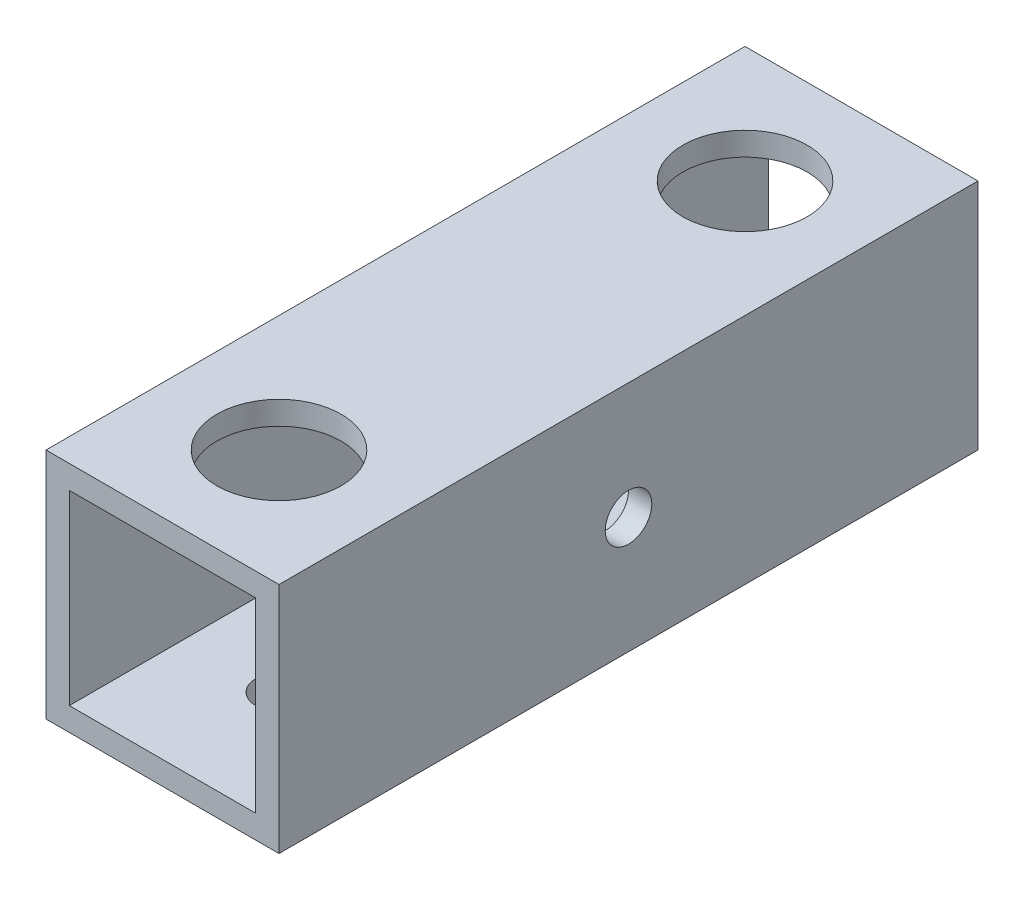
ISO-10303-21;
HEADER;
FILE_DESCRIPTION(('STEP AP214'),'2;1');
FILE_NAME('part.step','',(''),(''),'','','');
FILE_SCHEMA(('AUTOMOTIVE_DESIGN { 1 0 10303 214 1 1 1 1 }'));
ENDSEC;
DATA;
#1=APPLICATION_CONTEXT('core data for automotive mechanical design processes');
#2=APPLICATION_PROTOCOL_DEFINITION('international standard','automotive_design',2000,#1);
#3=PRODUCT_CONTEXT('',#1,'mechanical');
#4=PRODUCT('Part','Part','',(#3));
#5=PRODUCT_RELATED_PRODUCT_CATEGORY('part','',(#4));
#6=PRODUCT_DEFINITION_FORMATION('','',#4);
#7=PRODUCT_DEFINITION_CONTEXT('part definition',#1,'design');
#8=PRODUCT_DEFINITION('design','',#6,#7);
#9=PRODUCT_DEFINITION_SHAPE('','',#8);
#10=(LENGTH_UNIT() NAMED_UNIT(*) SI_UNIT(.MILLI.,.METRE.));
#11=(NAMED_UNIT(*) PLANE_ANGLE_UNIT() SI_UNIT($,.RADIAN.));
#12=(NAMED_UNIT(*) SI_UNIT($,.STERADIAN.) SOLID_ANGLE_UNIT());
#13=UNCERTAINTY_MEASURE_WITH_UNIT(LENGTH_MEASURE(1.E-05),#10,'distance_accuracy_value','');
#14=(GEOMETRIC_REPRESENTATION_CONTEXT(3) GLOBAL_UNCERTAINTY_ASSIGNED_CONTEXT((#13)) GLOBAL_UNIT_ASSIGNED_CONTEXT((#10,
#11,#12)) REPRESENTATION_CONTEXT('',''));
#15=CARTESIAN_POINT('',(0.,0.,0.));
#16=DIRECTION('',(0.,0.,1.));
#17=DIRECTION('',(1.,0.,0.));
#18=AXIS2_PLACEMENT_3D('',#15,#16,#17);
#19=CARTESIAN_POINT('',(0.,0.,45.));
#20=DIRECTION('',(0.,0.,1.));
#21=DIRECTION('',(1.,0.,0.));
#22=AXIS2_PLACEMENT_3D('',#19,#20,#21);
#23=PLANE('',#22);
#24=DIRECTION('',(0.,-1.,0.));
#25=VECTOR('',#24,1.);
#26=CARTESIAN_POINT('',(-7.01008414074451,7.73262608579252,45.));
#27=LINE('',#26,#25);
#28=CARTESIAN_POINT('',(-7.01008414074451,7.73262608579252,45.));
#29=VERTEX_POINT('',#28);
#30=CARTESIAN_POINT('',(-7.01008414074451,-7.26737391420748,45.));
#31=VERTEX_POINT('',#30);
#32=EDGE_CURVE('E138',#29,#31,#27,.T.);
#33=ORIENTED_EDGE('',*,*,#32,.T.);
#34=DIRECTION('',(1.,0.,0.));
#35=VECTOR('',#34,1.);
#36=CARTESIAN_POINT('',(-7.01008414074451,-7.26737391420748,45.));
#37=LINE('',#36,#35);
#38=CARTESIAN_POINT('',(7.98991585925548,-7.26737391420748,45.));
#39=VERTEX_POINT('',#38);
#40=EDGE_CURVE('E141',#31,#39,#37,.T.);
#41=ORIENTED_EDGE('',*,*,#40,.T.);
#42=DIRECTION('',(0.,1.,0.));
#43=VECTOR('',#42,1.);
#44=CARTESIAN_POINT('',(7.98991585925549,7.73262608579252,45.));
#45=LINE('',#44,#43);
#46=CARTESIAN_POINT('',(7.98991585925549,7.73262608579252,45.));
#47=VERTEX_POINT('',#46);
#48=EDGE_CURVE('E144',#39,#47,#45,.T.);
#49=ORIENTED_EDGE('',*,*,#48,.T.);
#50=DIRECTION('',(-1.,0.,0.));
#51=VECTOR('',#50,1.);
#52=CARTESIAN_POINT('',(-7.01008414074451,7.73262608579252,45.));
#53=LINE('',#52,#51);
#54=EDGE_CURVE('E146',#47,#29,#53,.T.);
#55=ORIENTED_EDGE('',*,*,#54,.T.);
#56=EDGE_LOOP('',(#33,#41,#49,#55));
#57=FACE_BOUND('',#56,.T.);
#58=DIRECTION('',(1.,0.,0.));
#59=VECTOR('',#58,1.);
#60=CARTESIAN_POINT('',(-5.51008414074451,-5.76737391420748,45.));
#61=LINE('',#60,#59);
#62=CARTESIAN_POINT('',(-5.51008414074451,-5.76737391420748,45.));
#63=VERTEX_POINT('',#62);
#64=CARTESIAN_POINT('',(6.48991585925549,-5.76737391420748,45.));
#65=VERTEX_POINT('',#64);
#66=EDGE_CURVE('E108',#63,#65,#61,.T.);
#67=ORIENTED_EDGE('',*,*,#66,.F.);
#68=DIRECTION('',(0.,-1.,0.));
#69=VECTOR('',#68,1.);
#70=CARTESIAN_POINT('',(-5.51008414074451,6.23262608579252,45.));
#71=LINE('',#70,#69);
#72=CARTESIAN_POINT('',(-5.51008414074451,6.23262608579252,45.));
#73=VERTEX_POINT('',#72);
#74=EDGE_CURVE('E100',#73,#63,#71,.T.);
#75=ORIENTED_EDGE('',*,*,#74,.F.);
#76=DIRECTION('',(-1.,0.,0.));
#77=VECTOR('',#76,1.);
#78=CARTESIAN_POINT('',(-5.51008414074451,6.23262608579252,45.));
#79=LINE('',#78,#77);
#80=CARTESIAN_POINT('',(6.48991585925549,6.23262608579252,45.));
#81=VERTEX_POINT('',#80);
#82=EDGE_CURVE('E122',#81,#73,#79,.T.);
#83=ORIENTED_EDGE('',*,*,#82,.F.);
#84=DIRECTION('',(0.,1.,0.));
#85=VECTOR('',#84,1.);
#86=CARTESIAN_POINT('',(6.48991585925549,6.23262608579252,45.));
#87=LINE('',#86,#85);
#88=EDGE_CURVE('E120',#65,#81,#87,.T.);
#89=ORIENTED_EDGE('',*,*,#88,.F.);
#90=EDGE_LOOP('',(#67,#75,#83,#89));
#91=FACE_BOUND('',#90,.T.);
#92=ADVANCED_FACE('F33',(#57,#91),#23,.T.);
#93=CARTESIAN_POINT('',(0.,0.,0.));
#94=DIRECTION('',(0.,0.,1.));
#95=DIRECTION('',(1.,0.,0.));
#96=AXIS2_PLACEMENT_3D('',#93,#94,#95);
#97=PLANE('',#96);
#98=DIRECTION('',(0.,-1.,0.));
#99=VECTOR('',#98,1.);
#100=CARTESIAN_POINT('',(-7.01008414074451,7.73262608579252,0.));
#101=LINE('',#100,#99);
#102=CARTESIAN_POINT('',(-7.01008414074451,7.73262608579252,0.));
#103=VERTEX_POINT('',#102);
#104=CARTESIAN_POINT('',(-7.01008414074451,-7.26737391420748,0.));
#105=VERTEX_POINT('',#104);
#106=EDGE_CURVE('E116',#103,#105,#101,.T.);
#107=ORIENTED_EDGE('',*,*,#106,.F.);
#108=DIRECTION('',(-1.,0.,0.));
#109=VECTOR('',#108,1.);
#110=CARTESIAN_POINT('',(-7.01008414074451,7.73262608579252,0.));
#111=LINE('',#110,#109);
#112=CARTESIAN_POINT('',(7.98991585925549,7.73262608579252,0.));
#113=VERTEX_POINT('',#112);
#114=EDGE_CURVE('E142',#113,#103,#111,.T.);
#115=ORIENTED_EDGE('',*,*,#114,.F.);
#116=DIRECTION('',(0.,1.,0.));
#117=VECTOR('',#116,1.);
#118=CARTESIAN_POINT('',(7.98991585925549,7.73262608579252,0.));
#119=LINE('',#118,#117);
#120=CARTESIAN_POINT('',(7.98991585925548,-7.26737391420748,0.));
#121=VERTEX_POINT('',#120);
#122=EDGE_CURVE('E153',#121,#113,#119,.T.);
#123=ORIENTED_EDGE('',*,*,#122,.F.);
#124=DIRECTION('',(1.,0.,0.));
#125=VECTOR('',#124,1.);
#126=CARTESIAN_POINT('',(-7.01008414074451,-7.26737391420748,0.));
#127=LINE('',#126,#125);
#128=EDGE_CURVE('E151',#105,#121,#127,.T.);
#129=ORIENTED_EDGE('',*,*,#128,.F.);
#130=EDGE_LOOP('',(#107,#115,#123,#129));
#131=FACE_BOUND('',#130,.T.);
#132=DIRECTION('',(0.,-1.,0.));
#133=VECTOR('',#132,1.);
#134=CARTESIAN_POINT('',(-5.51008414074451,6.23262608579252,0.));
#135=LINE('',#134,#133);
#136=CARTESIAN_POINT('',(-5.51008414074451,6.23262608579252,0.));
#137=VERTEX_POINT('',#136);
#138=CARTESIAN_POINT('',(-5.51008414074451,-5.76737391420748,0.));
#139=VERTEX_POINT('',#138);
#140=EDGE_CURVE('E58',#137,#139,#135,.T.);
#141=ORIENTED_EDGE('',*,*,#140,.T.);
#142=DIRECTION('',(1.,0.,0.));
#143=VECTOR('',#142,1.);
#144=CARTESIAN_POINT('',(-5.51008414074451,-5.76737391420748,0.));
#145=LINE('',#144,#143);
#146=CARTESIAN_POINT('',(6.48991585925549,-5.76737391420748,0.));
#147=VERTEX_POINT('',#146);
#148=EDGE_CURVE('E115',#139,#147,#145,.T.);
#149=ORIENTED_EDGE('',*,*,#148,.T.);
#150=DIRECTION('',(0.,1.,0.));
#151=VECTOR('',#150,1.);
#152=CARTESIAN_POINT('',(6.48991585925549,6.23262608579252,0.));
#153=LINE('',#152,#151);
#154=CARTESIAN_POINT('',(6.48991585925549,6.23262608579252,0.));
#155=VERTEX_POINT('',#154);
#156=EDGE_CURVE('E130',#147,#155,#153,.T.);
#157=ORIENTED_EDGE('',*,*,#156,.T.);
#158=DIRECTION('',(-1.,0.,0.));
#159=VECTOR('',#158,1.);
#160=CARTESIAN_POINT('',(-5.51008414074451,6.23262608579252,0.));
#161=LINE('',#160,#159);
#162=EDGE_CURVE('E109',#155,#137,#161,.T.);
#163=ORIENTED_EDGE('',*,*,#162,.T.);
#164=EDGE_LOOP('',(#141,#149,#157,#163));
#165=FACE_BOUND('',#164,.T.);
#166=ADVANCED_FACE('F217',(#131,#165),#97,.F.);
#167=CARTESIAN_POINT('',(-7.01008414074451,7.73262608579252,45.));
#168=DIRECTION('',(1.,0.,0.));
#169=DIRECTION('',(0.,1.,0.));
#170=AXIS2_PLACEMENT_3D('',#167,#168,#169);
#171=PLANE('',#170);
#172=CARTESIAN_POINT('',(-7.01008414074451,0.232626085792516,22.5));
#173=DIRECTION('',(-1.,0.,0.));
#174=DIRECTION('',(0.,-1.,0.));
#175=AXIS2_PLACEMENT_3D('',#172,#173,#174);
#176=CIRCLE('',#175,4.);
#177=CARTESIAN_POINT('',(-7.01008414074451,-3.76737391420748,22.5));
#178=VERTEX_POINT('',#177);
#179=EDGE_CURVE('E176',#178,#178,#176,.T.);
#180=ORIENTED_EDGE('',*,*,#179,.F.);
#181=EDGE_LOOP('',(#180));
#182=FACE_BOUND('',#181,.T.);
#183=ORIENTED_EDGE('',*,*,#106,.T.);
#184=DIRECTION('',(0.,0.,-1.));
#185=VECTOR('',#184,1.);
#186=CARTESIAN_POINT('',(-7.01008414074451,-7.26737391420748,45.));
#187=LINE('',#186,#185);
#188=EDGE_CURVE('E11',#31,#105,#187,.T.);
#189=ORIENTED_EDGE('',*,*,#188,.F.);
#190=ORIENTED_EDGE('',*,*,#32,.F.);
#191=DIRECTION('',(0.,0.,-1.));
#192=VECTOR('',#191,1.);
#193=CARTESIAN_POINT('',(-7.01008414074451,7.73262608579252,45.));
#194=LINE('',#193,#192);
#195=EDGE_CURVE('E148',#29,#103,#194,.T.);
#196=ORIENTED_EDGE('',*,*,#195,.T.);
#197=EDGE_LOOP('',(#183,#189,#190,#196));
#198=FACE_BOUND('',#197,.T.);
#199=ADVANCED_FACE('F35',(#182,#198),#171,.F.);
#200=CARTESIAN_POINT('',(-7.01008414074451,-7.26737391420748,45.));
#201=DIRECTION('',(0.,1.,0.));
#202=DIRECTION('',(0.,0.,1.));
#203=AXIS2_PLACEMENT_3D('',#200,#201,#202);
#204=PLANE('',#203);
#205=CARTESIAN_POINT('',(0.489915859255484,-7.26737391420748,37.5));
#206=DIRECTION('',(0.,-1.,0.));
#207=DIRECTION('',(0.,0.,-1.));
#208=AXIS2_PLACEMENT_3D('',#205,#206,#207);
#209=CIRCLE('',#208,1.5);
#210=CARTESIAN_POINT('',(0.489915859255484,-7.26737391420748,36.));
#211=VERTEX_POINT('',#210);
#212=EDGE_CURVE('E170',#211,#211,#209,.T.);
#213=ORIENTED_EDGE('',*,*,#212,.F.);
#214=EDGE_LOOP('',(#213));
#215=FACE_BOUND('',#214,.T.);
#216=CARTESIAN_POINT('',(0.489915859255484,-7.26737391420748,7.5));
#217=DIRECTION('',(0.,-1.,0.));
#218=DIRECTION('',(0.,0.,-1.));
#219=AXIS2_PLACEMENT_3D('',#216,#217,#218);
#220=CIRCLE('',#219,1.5);
#221=CARTESIAN_POINT('',(0.489915859255484,-7.26737391420748,6.));
#222=VERTEX_POINT('',#221);
#223=EDGE_CURVE('E175',#222,#222,#220,.T.);
#224=ORIENTED_EDGE('',*,*,#223,.F.);
#225=EDGE_LOOP('',(#224));
#226=FACE_BOUND('',#225,.T.);
#227=ORIENTED_EDGE('',*,*,#128,.T.);
#228=DIRECTION('',(0.,0.,-1.));
#229=VECTOR('',#228,1.);
#230=CARTESIAN_POINT('',(7.98991585925548,-7.26737391420748,45.));
#231=LINE('',#230,#229);
#232=EDGE_CURVE('E42',#39,#121,#231,.T.);
#233=ORIENTED_EDGE('',*,*,#232,.F.);
#234=ORIENTED_EDGE('',*,*,#40,.F.);
#235=ORIENTED_EDGE('',*,*,#188,.T.);
#236=EDGE_LOOP('',(#227,#233,#234,#235));
#237=FACE_BOUND('',#236,.T.);
#238=ADVANCED_FACE('F205',(#215,#226,#237),#204,.F.);
#239=CARTESIAN_POINT('',(7.98991585925549,7.73262608579252,45.));
#240=DIRECTION('',(-1.,0.,0.));
#241=DIRECTION('',(0.,-1.,0.));
#242=AXIS2_PLACEMENT_3D('',#239,#240,#241);
#243=PLANE('',#242);
#244=CARTESIAN_POINT('',(7.98991585925548,0.232626085792518,22.5));
#245=DIRECTION('',(1.,0.,0.));
#246=DIRECTION('',(0.,1.,0.));
#247=AXIS2_PLACEMENT_3D('',#244,#245,#246);
#248=CIRCLE('',#247,1.5);
#249=CARTESIAN_POINT('',(7.98991585925548,1.73262608579252,22.5));
#250=VERTEX_POINT('',#249);
#251=EDGE_CURVE('E165',#250,#250,#248,.T.);
#252=ORIENTED_EDGE('',*,*,#251,.F.);
#253=EDGE_LOOP('',(#252));
#254=FACE_BOUND('',#253,.T.);
#255=ORIENTED_EDGE('',*,*,#122,.T.);
#256=DIRECTION('',(0.,0.,-1.));
#257=VECTOR('',#256,1.);
#258=CARTESIAN_POINT('',(7.98991585925549,7.73262608579252,45.));
#259=LINE('',#258,#257);
#260=EDGE_CURVE('E158',#47,#113,#259,.T.);
#261=ORIENTED_EDGE('',*,*,#260,.F.);
#262=ORIENTED_EDGE('',*,*,#48,.F.);
#263=ORIENTED_EDGE('',*,*,#232,.T.);
#264=EDGE_LOOP('',(#255,#261,#262,#263));
#265=FACE_BOUND('',#264,.T.);
#266=ADVANCED_FACE('F201',(#254,#265),#243,.F.);
#267=CARTESIAN_POINT('',(-7.01008414074451,7.73262608579252,45.));
#268=DIRECTION('',(0.,-1.,0.));
#269=DIRECTION('',(0.,0.,-1.));
#270=AXIS2_PLACEMENT_3D('',#267,#268,#269);
#271=PLANE('',#270);
#272=CARTESIAN_POINT('',(0.489915859255484,7.73262608579252,7.5));
#273=DIRECTION('',(0.,1.,0.));
#274=DIRECTION('',(0.,0.,1.));
#275=AXIS2_PLACEMENT_3D('',#272,#273,#274);
#276=CIRCLE('',#275,4.);
#277=CARTESIAN_POINT('',(0.489915859255484,7.73262608579252,11.5));
#278=VERTEX_POINT('',#277);
#279=EDGE_CURVE('E179',#278,#278,#276,.T.);
#280=ORIENTED_EDGE('',*,*,#279,.F.);
#281=EDGE_LOOP('',(#280));
#282=FACE_BOUND('',#281,.T.);
#283=CARTESIAN_POINT('',(0.489915859255484,7.73262608579252,37.5));
#284=DIRECTION('',(0.,1.,0.));
#285=DIRECTION('',(0.,0.,1.));
#286=AXIS2_PLACEMENT_3D('',#283,#284,#285);
#287=CIRCLE('',#286,4.);
#288=CARTESIAN_POINT('',(0.489915859255484,7.73262608579252,41.5));
#289=VERTEX_POINT('',#288);
#290=EDGE_CURVE('E184',#289,#289,#287,.T.);
#291=ORIENTED_EDGE('',*,*,#290,.F.);
#292=EDGE_LOOP('',(#291));
#293=FACE_BOUND('',#292,.T.);
#294=ORIENTED_EDGE('',*,*,#114,.T.);
#295=ORIENTED_EDGE('',*,*,#195,.F.);
#296=ORIENTED_EDGE('',*,*,#54,.F.);
#297=ORIENTED_EDGE('',*,*,#260,.T.);
#298=EDGE_LOOP('',(#294,#295,#296,#297));
#299=FACE_BOUND('',#298,.T.);
#300=ADVANCED_FACE('F204',(#282,#293,#299),#271,.F.);
#301=CARTESIAN_POINT('',(-5.51008414074451,6.23262608579252,45.));
#302=DIRECTION('',(1.,0.,0.));
#303=DIRECTION('',(0.,1.,0.));
#304=AXIS2_PLACEMENT_3D('',#301,#302,#303);
#305=PLANE('',#304);
#306=CARTESIAN_POINT('',(-5.51008414074451,0.232626085792516,22.5));
#307=DIRECTION('',(1.,0.,0.));
#308=DIRECTION('',(0.,1.,0.));
#309=AXIS2_PLACEMENT_3D('',#306,#307,#308);
#310=CIRCLE('',#309,4.);
#311=CARTESIAN_POINT('',(-5.51008414074451,4.23262608579252,22.5));
#312=VERTEX_POINT('',#311);
#313=EDGE_CURVE('E173',#312,#312,#310,.T.);
#314=ORIENTED_EDGE('',*,*,#313,.F.);
#315=EDGE_LOOP('',(#314));
#316=FACE_BOUND('',#315,.T.);
#317=ORIENTED_EDGE('',*,*,#140,.F.);
#318=DIRECTION('',(0.,0.,-1.));
#319=VECTOR('',#318,1.);
#320=CARTESIAN_POINT('',(-5.51008414074451,6.23262608579252,45.));
#321=LINE('',#320,#319);
#322=EDGE_CURVE('E104',#73,#137,#321,.T.);
#323=ORIENTED_EDGE('',*,*,#322,.F.);
#324=ORIENTED_EDGE('',*,*,#74,.T.);
#325=DIRECTION('',(0.,0.,-1.));
#326=VECTOR('',#325,1.);
#327=CARTESIAN_POINT('',(-5.51008414074451,-5.76737391420748,45.));
#328=LINE('',#327,#326);
#329=EDGE_CURVE('E103',#63,#139,#328,.T.);
#330=ORIENTED_EDGE('',*,*,#329,.T.);
#331=EDGE_LOOP('',(#317,#323,#324,#330));
#332=FACE_BOUND('',#331,.T.);
#333=ADVANCED_FACE('F102',(#316,#332),#305,.T.);
#334=CARTESIAN_POINT('',(-5.51008414074451,-5.76737391420748,45.));
#335=DIRECTION('',(0.,1.,0.));
#336=DIRECTION('',(0.,0.,1.));
#337=AXIS2_PLACEMENT_3D('',#334,#335,#336);
#338=PLANE('',#337);
#339=CARTESIAN_POINT('',(0.489915859255484,-5.76737391420748,37.5));
#340=DIRECTION('',(0.,1.,0.));
#341=DIRECTION('',(0.,0.,1.));
#342=AXIS2_PLACEMENT_3D('',#339,#340,#341);
#343=CIRCLE('',#342,1.5);
#344=CARTESIAN_POINT('',(0.489915859255484,-5.76737391420748,39.));
#345=VERTEX_POINT('',#344);
#346=EDGE_CURVE('E169',#345,#345,#343,.T.);
#347=ORIENTED_EDGE('',*,*,#346,.F.);
#348=EDGE_LOOP('',(#347));
#349=FACE_BOUND('',#348,.T.);
#350=CARTESIAN_POINT('',(0.489915859255484,-5.76737391420748,7.5));
#351=DIRECTION('',(0.,1.,0.));
#352=DIRECTION('',(0.,0.,1.));
#353=AXIS2_PLACEMENT_3D('',#350,#351,#352);
#354=CIRCLE('',#353,1.5);
#355=CARTESIAN_POINT('',(0.489915859255484,-5.76737391420748,9.));
#356=VERTEX_POINT('',#355);
#357=EDGE_CURVE('E166',#356,#356,#354,.T.);
#358=ORIENTED_EDGE('',*,*,#357,.F.);
#359=EDGE_LOOP('',(#358));
#360=FACE_BOUND('',#359,.T.);
#361=ORIENTED_EDGE('',*,*,#148,.F.);
#362=ORIENTED_EDGE('',*,*,#329,.F.);
#363=ORIENTED_EDGE('',*,*,#66,.T.);
#364=DIRECTION('',(0.,0.,-1.));
#365=VECTOR('',#364,1.);
#366=CARTESIAN_POINT('',(6.48991585925549,-5.76737391420748,45.));
#367=LINE('',#366,#365);
#368=EDGE_CURVE('E117',#65,#147,#367,.T.);
#369=ORIENTED_EDGE('',*,*,#368,.T.);
#370=EDGE_LOOP('',(#361,#362,#363,#369));
#371=FACE_BOUND('',#370,.T.);
#372=ADVANCED_FACE('F112',(#349,#360,#371),#338,.T.);
#373=CARTESIAN_POINT('',(6.48991585925549,6.23262608579252,45.));
#374=DIRECTION('',(-1.,0.,0.));
#375=DIRECTION('',(0.,-1.,0.));
#376=AXIS2_PLACEMENT_3D('',#373,#374,#375);
#377=PLANE('',#376);
#378=CARTESIAN_POINT('',(6.48991585925549,0.232626085792519,22.5));
#379=DIRECTION('',(-1.,0.,0.));
#380=DIRECTION('',(0.,-1.,0.));
#381=AXIS2_PLACEMENT_3D('',#378,#379,#380);
#382=CIRCLE('',#381,1.5);
#383=CARTESIAN_POINT('',(6.48991585925549,-1.26737391420748,22.5));
#384=VERTEX_POINT('',#383);
#385=EDGE_CURVE('E128',#384,#384,#382,.T.);
#386=ORIENTED_EDGE('',*,*,#385,.F.);
#387=EDGE_LOOP('',(#386));
#388=FACE_BOUND('',#387,.T.);
#389=ORIENTED_EDGE('',*,*,#156,.F.);
#390=ORIENTED_EDGE('',*,*,#368,.F.);
#391=ORIENTED_EDGE('',*,*,#88,.T.);
#392=DIRECTION('',(0.,0.,-1.));
#393=VECTOR('',#392,1.);
#394=CARTESIAN_POINT('',(6.48991585925549,6.23262608579252,45.));
#395=LINE('',#394,#393);
#396=EDGE_CURVE('E50',#81,#155,#395,.T.);
#397=ORIENTED_EDGE('',*,*,#396,.T.);
#398=EDGE_LOOP('',(#389,#390,#391,#397));
#399=FACE_BOUND('',#398,.T.);
#400=ADVANCED_FACE('F278',(#388,#399),#377,.T.);
#401=CARTESIAN_POINT('',(-5.51008414074451,6.23262608579252,45.));
#402=DIRECTION('',(0.,-1.,0.));
#403=DIRECTION('',(0.,0.,-1.));
#404=AXIS2_PLACEMENT_3D('',#401,#402,#403);
#405=PLANE('',#404);
#406=CARTESIAN_POINT('',(0.489915859255484,6.23262608579252,7.5));
#407=DIRECTION('',(0.,-1.,0.));
#408=DIRECTION('',(0.,0.,-1.));
#409=AXIS2_PLACEMENT_3D('',#406,#407,#408);
#410=CIRCLE('',#409,4.);
#411=CARTESIAN_POINT('',(0.489915859255484,6.23262608579252,3.5));
#412=VERTEX_POINT('',#411);
#413=EDGE_CURVE('E37',#412,#412,#410,.T.);
#414=ORIENTED_EDGE('',*,*,#413,.F.);
#415=EDGE_LOOP('',(#414));
#416=FACE_BOUND('',#415,.T.);
#417=CARTESIAN_POINT('',(0.489915859255484,6.23262608579252,37.5));
#418=DIRECTION('',(0.,-1.,0.));
#419=DIRECTION('',(0.,0.,-1.));
#420=AXIS2_PLACEMENT_3D('',#417,#418,#419);
#421=CIRCLE('',#420,4.);
#422=CARTESIAN_POINT('',(0.489915859255484,6.23262608579252,33.5));
#423=VERTEX_POINT('',#422);
#424=EDGE_CURVE('E177',#423,#423,#421,.T.);
#425=ORIENTED_EDGE('',*,*,#424,.F.);
#426=EDGE_LOOP('',(#425));
#427=FACE_BOUND('',#426,.T.);
#428=ORIENTED_EDGE('',*,*,#162,.F.);
#429=ORIENTED_EDGE('',*,*,#396,.F.);
#430=ORIENTED_EDGE('',*,*,#82,.T.);
#431=ORIENTED_EDGE('',*,*,#322,.T.);
#432=EDGE_LOOP('',(#428,#429,#430,#431));
#433=FACE_BOUND('',#432,.T.);
#434=ADVANCED_FACE('F274',(#416,#427,#433),#405,.T.);
#435=CARTESIAN_POINT('',(-2.01008414074452,0.232626085792521,22.5));
#436=DIRECTION('',(1.,0.,0.));
#437=DIRECTION('',(0.,1.,0.));
#438=AXIS2_PLACEMENT_3D('',#435,#436,#437);
#439=CYLINDRICAL_SURFACE('',#438,1.5);
#440=ORIENTED_EDGE('',*,*,#385,.T.);
#441=EDGE_LOOP('',(#440));
#442=FACE_BOUND('',#441,.T.);
#443=ORIENTED_EDGE('',*,*,#251,.T.);
#444=EDGE_LOOP('',(#443));
#445=FACE_BOUND('',#444,.T.);
#446=ADVANCED_FACE('F199',(#442,#445),#439,.F.);
#447=CARTESIAN_POINT('',(0.489915859255484,2.73262608579252,7.5));
#448=DIRECTION('',(0.,-1.,0.));
#449=DIRECTION('',(0.,0.,-1.));
#450=AXIS2_PLACEMENT_3D('',#447,#448,#449);
#451=CYLINDRICAL_SURFACE('',#450,1.5);
#452=ORIENTED_EDGE('',*,*,#357,.T.);
#453=EDGE_LOOP('',(#452));
#454=FACE_BOUND('',#453,.T.);
#455=ORIENTED_EDGE('',*,*,#223,.T.);
#456=EDGE_LOOP('',(#455));
#457=FACE_BOUND('',#456,.T.);
#458=ADVANCED_FACE('F267',(#454,#457),#451,.F.);
#459=CARTESIAN_POINT('',(0.489915859255484,2.73262608579252,37.5));
#460=DIRECTION('',(0.,-1.,0.));
#461=DIRECTION('',(0.,0.,-1.));
#462=AXIS2_PLACEMENT_3D('',#459,#460,#461);
#463=CYLINDRICAL_SURFACE('',#462,1.5);
#464=ORIENTED_EDGE('',*,*,#346,.T.);
#465=EDGE_LOOP('',(#464));
#466=FACE_BOUND('',#465,.T.);
#467=ORIENTED_EDGE('',*,*,#212,.T.);
#468=EDGE_LOOP('',(#467));
#469=FACE_BOUND('',#468,.T.);
#470=ADVANCED_FACE('F261',(#466,#469),#463,.F.);
#471=CARTESIAN_POINT('',(2.98991585925549,0.232626085792518,22.5));
#472=DIRECTION('',(-1.,0.,0.));
#473=DIRECTION('',(0.,-1.,0.));
#474=AXIS2_PLACEMENT_3D('',#471,#472,#473);
#475=CYLINDRICAL_SURFACE('',#474,4.);
#476=ORIENTED_EDGE('',*,*,#313,.T.);
#477=EDGE_LOOP('',(#476));
#478=FACE_BOUND('',#477,.T.);
#479=ORIENTED_EDGE('',*,*,#179,.T.);
#480=EDGE_LOOP('',(#479));
#481=FACE_BOUND('',#480,.T.);
#482=ADVANCED_FACE('F253',(#478,#481),#475,.F.);
#483=CARTESIAN_POINT('',(0.489915859255484,-2.26737391420748,37.5));
#484=DIRECTION('',(0.,1.,0.));
#485=DIRECTION('',(0.,0.,1.));
#486=AXIS2_PLACEMENT_3D('',#483,#484,#485);
#487=CYLINDRICAL_SURFACE('',#486,4.);
#488=ORIENTED_EDGE('',*,*,#424,.T.);
#489=EDGE_LOOP('',(#488));
#490=FACE_BOUND('',#489,.T.);
#491=ORIENTED_EDGE('',*,*,#290,.T.);
#492=EDGE_LOOP('',(#491));
#493=FACE_BOUND('',#492,.T.);
#494=ADVANCED_FACE('F250',(#490,#493),#487,.F.);
#495=CARTESIAN_POINT('',(0.489915859255484,-2.26737391420748,7.5));
#496=DIRECTION('',(0.,1.,0.));
#497=DIRECTION('',(0.,0.,1.));
#498=AXIS2_PLACEMENT_3D('',#495,#496,#497);
#499=CYLINDRICAL_SURFACE('',#498,4.);
#500=ORIENTED_EDGE('',*,*,#413,.T.);
#501=EDGE_LOOP('',(#500));
#502=FACE_BOUND('',#501,.T.);
#503=ORIENTED_EDGE('',*,*,#279,.T.);
#504=EDGE_LOOP('',(#503));
#505=FACE_BOUND('',#504,.T.);
#506=ADVANCED_FACE('F252',(#502,#505),#499,.F.);
#507=CLOSED_SHELL('',(#92,#166,#199,#238,#266,#300,#333,#372,#400,#434,#446,#458,#470,#482,#494,#506));
#508=MANIFOLD_SOLID_BREP('B2',#507);
#509=ADVANCED_BREP_SHAPE_REPRESENTATION('',(#18,#508),#14);
#510=SHAPE_DEFINITION_REPRESENTATION(#9,#509);
ENDSEC;
END-ISO-10303-21;
